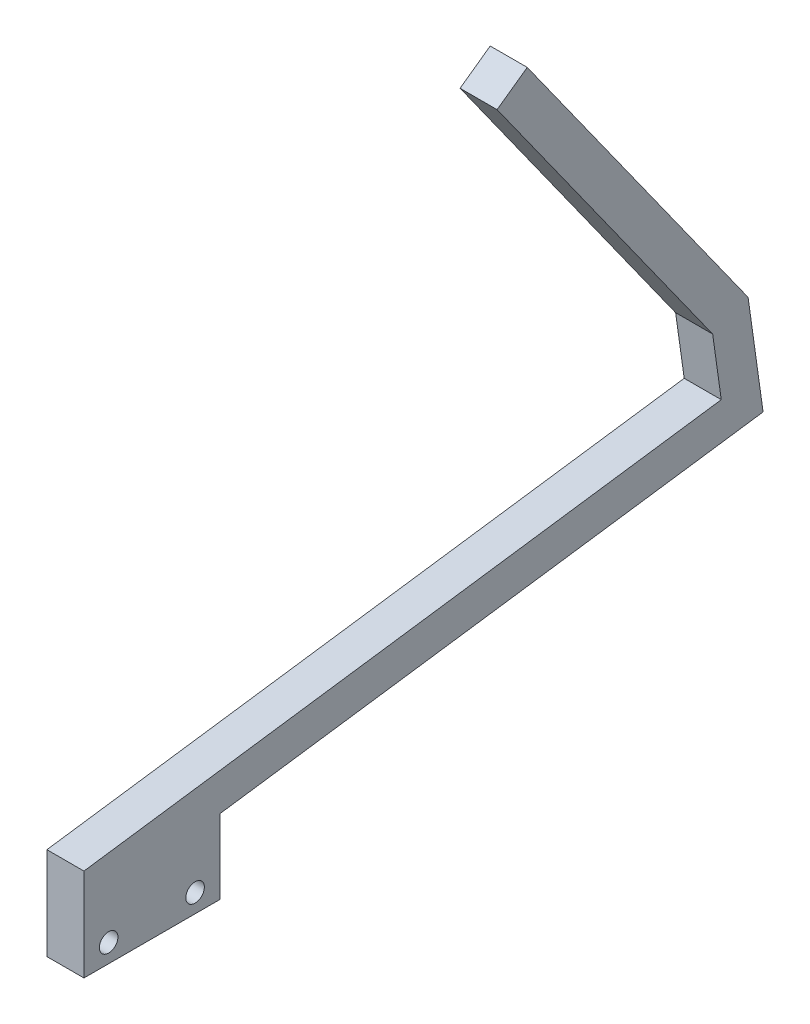
ISO-10303-21;
HEADER;
FILE_DESCRIPTION(('STEP AP214'),'2;1');
FILE_NAME('part.step','',(''),(''),'','','');
FILE_SCHEMA(('AUTOMOTIVE_DESIGN { 1 0 10303 214 1 1 1 1 }'));
ENDSEC;
DATA;
#1=APPLICATION_CONTEXT('core data for automotive mechanical design processes');
#2=APPLICATION_PROTOCOL_DEFINITION('international standard','automotive_design',2000,#1);
#3=PRODUCT_CONTEXT('',#1,'mechanical');
#4=PRODUCT('Part','Part','',(#3));
#5=PRODUCT_RELATED_PRODUCT_CATEGORY('part','',(#4));
#6=PRODUCT_DEFINITION_FORMATION('','',#4);
#7=PRODUCT_DEFINITION_CONTEXT('part definition',#1,'design');
#8=PRODUCT_DEFINITION('design','',#6,#7);
#9=PRODUCT_DEFINITION_SHAPE('','',#8);
#10=(LENGTH_UNIT() NAMED_UNIT(*) SI_UNIT(.MILLI.,.METRE.));
#11=(NAMED_UNIT(*) PLANE_ANGLE_UNIT() SI_UNIT($,.RADIAN.));
#12=(NAMED_UNIT(*) SI_UNIT($,.STERADIAN.) SOLID_ANGLE_UNIT());
#13=UNCERTAINTY_MEASURE_WITH_UNIT(LENGTH_MEASURE(1.E-05),#10,'distance_accuracy_value','');
#14=(GEOMETRIC_REPRESENTATION_CONTEXT(3) GLOBAL_UNCERTAINTY_ASSIGNED_CONTEXT((#13)) GLOBAL_UNIT_ASSIGNED_CONTEXT((#10,
#11,#12)) REPRESENTATION_CONTEXT('',''));
#15=CARTESIAN_POINT('',(0.,0.,0.));
#16=DIRECTION('',(0.,0.,1.));
#17=DIRECTION('',(1.,0.,0.));
#18=AXIS2_PLACEMENT_3D('',#15,#16,#17);
#19=CARTESIAN_POINT('',(6.,0.,0.));
#20=DIRECTION('',(-1.,0.,0.));
#21=DIRECTION('',(0.,0.,1.));
#22=AXIS2_PLACEMENT_3D('',#19,#20,#21);
#23=PLANE('',#22);
#24=CARTESIAN_POINT('',(6.,3.,-4.));
#25=DIRECTION('',(1.,0.,0.));
#26=DIRECTION('',(0.,0.,-1.));
#27=AXIS2_PLACEMENT_3D('',#24,#25,#26);
#28=CIRCLE('',#27,1.5);
#29=CARTESIAN_POINT('',(6.,3.,-5.5));
#30=VERTEX_POINT('',#29);
#31=EDGE_CURVE('E146',#30,#30,#28,.T.);
#32=ORIENTED_EDGE('',*,*,#31,.F.);
#33=EDGE_LOOP('',(#32));
#34=FACE_BOUND('',#33,.T.);
#35=DIRECTION('',(0.,0.,-1.));
#36=VECTOR('',#35,1.);
#37=CARTESIAN_POINT('',(6.,0.,-22.));
#38=LINE('',#37,#36);
#39=CARTESIAN_POINT('',(6.,0.,0.));
#40=VERTEX_POINT('',#39);
#41=CARTESIAN_POINT('',(6.,0.,-22.));
#42=VERTEX_POINT('',#41);
#43=EDGE_CURVE('E161',#40,#42,#38,.T.);
#44=ORIENTED_EDGE('',*,*,#43,.T.);
#45=DIRECTION('',(0.,1.,0.));
#46=VECTOR('',#45,1.);
#47=CARTESIAN_POINT('',(6.,12.0329329283409,-22.));
#48=LINE('',#47,#46);
#49=CARTESIAN_POINT('',(6.,12.0329329283409,-22.));
#50=VERTEX_POINT('',#49);
#51=EDGE_CURVE('E99',#42,#50,#48,.T.);
#52=ORIENTED_EDGE('',*,*,#51,.T.);
#53=DIRECTION('',(0.,0.139173100960066,-0.99026806874157));
#54=VECTOR('',#53,1.);
#55=CARTESIAN_POINT('',(6.,24.4005263821514,-110.));
#56=LINE('',#55,#54);
#57=CARTESIAN_POINT('',(6.,24.4005263821514,-110.));
#58=VERTEX_POINT('',#57);
#59=EDGE_CURVE('E182',#50,#58,#56,.T.);
#60=ORIENTED_EDGE('',*,*,#59,.T.);
#61=DIRECTION('',(0.,0.99026806874157,0.139173100960066));
#62=VECTOR('',#61,1.);
#63=CARTESIAN_POINT('',(6.,41.6991241959934,-107.568840624062));
#64=LINE('',#63,#62);
#65=CARTESIAN_POINT('',(6.,41.6991241959934,-107.568840624062));
#66=VERTEX_POINT('',#65);
#67=EDGE_CURVE('E201',#58,#66,#64,.T.);
#68=ORIENTED_EDGE('',*,*,#67,.T.);
#69=DIRECTION('',(0.,0.814040564378037,0.58080802297066));
#70=VECTOR('',#69,1.);
#71=CARTESIAN_POINT('',(6.,91.830419974695,-71.8007719745203));
#72=LINE('',#71,#70);
#73=CARTESIAN_POINT('',(6.,91.830419974695,-71.8007719745203));
#74=VERTEX_POINT('',#73);
#75=EDGE_CURVE('E198',#66,#74,#72,.T.);
#76=ORIENTED_EDGE('',*,*,#75,.T.);
#77=DIRECTION('',(0.,-0.58080802297066,0.814040564378037));
#78=VECTOR('',#77,1.);
#79=CARTESIAN_POINT('',(6.,88.345571836871,-66.916528588252));
#80=LINE('',#79,#78);
#81=CARTESIAN_POINT('',(6.,88.345571836871,-66.916528588252));
#82=VERTEX_POINT('',#81);
#83=EDGE_CURVE('E200',#74,#82,#80,.T.);
#84=ORIENTED_EDGE('',*,*,#83,.T.);
#85=DIRECTION('',(0.,-0.814040564378037,-0.58080802297066));
#86=VECTOR('',#85,1.);
#87=CARTESIAN_POINT('',(6.,39.4097768762561,-101.83162197219));
#88=LINE('',#87,#86);
#89=CARTESIAN_POINT('',(6.,39.4097768762561,-101.83162197219));
#90=VERTEX_POINT('',#89);
#91=EDGE_CURVE('E124',#82,#90,#88,.T.);
#92=ORIENTED_EDGE('',*,*,#91,.T.);
#93=DIRECTION('',(0.,-0.99026806874157,-0.139173100960066));
#94=VECTOR('',#93,1.);
#95=CARTESIAN_POINT('',(6.,29.5070961888404,-103.22335298179));
#96=LINE('',#95,#94);
#97=CARTESIAN_POINT('',(6.,29.5070961888404,-103.22335298179));
#98=VERTEX_POINT('',#97);
#99=EDGE_CURVE('E118',#90,#98,#96,.T.);
#100=ORIENTED_EDGE('',*,*,#99,.T.);
#101=DIRECTION('',(0.,-0.139173100960066,0.99026806874157));
#102=VECTOR('',#101,1.);
#103=CARTESIAN_POINT('',(6.,15.,0.));
#104=LINE('',#103,#102);
#105=CARTESIAN_POINT('',(6.,15.,0.));
#106=VERTEX_POINT('',#105);
#107=EDGE_CURVE('E122',#98,#106,#104,.T.);
#108=ORIENTED_EDGE('',*,*,#107,.T.);
#109=DIRECTION('',(0.,-1.,0.));
#110=VECTOR('',#109,1.);
#111=CARTESIAN_POINT('',(6.,0.,0.));
#112=LINE('',#111,#110);
#113=EDGE_CURVE('E50',#106,#40,#112,.T.);
#114=ORIENTED_EDGE('',*,*,#113,.T.);
#115=EDGE_LOOP('',(#44,#52,#60,#68,#76,#84,#92,#100,#108,#114));
#116=FACE_BOUND('',#115,.T.);
#117=CARTESIAN_POINT('',(6.,3.,-18.));
#118=DIRECTION('',(1.,0.,0.));
#119=DIRECTION('',(0.,0.,-1.));
#120=AXIS2_PLACEMENT_3D('',#117,#118,#119);
#121=CIRCLE('',#120,1.5);
#122=CARTESIAN_POINT('',(6.,3.,-19.5));
#123=VERTEX_POINT('',#122);
#124=EDGE_CURVE('E212',#123,#123,#121,.T.);
#125=ORIENTED_EDGE('',*,*,#124,.F.);
#126=EDGE_LOOP('',(#125));
#127=FACE_BOUND('',#126,.T.);
#128=ADVANCED_FACE('F33',(#34,#116,#127),#23,.F.);
#129=CARTESIAN_POINT('',(0.,0.,0.));
#130=DIRECTION('',(-1.,0.,0.));
#131=DIRECTION('',(0.,0.,1.));
#132=AXIS2_PLACEMENT_3D('',#129,#130,#131);
#133=PLANE('',#132);
#134=CARTESIAN_POINT('',(0.,3.,-4.));
#135=DIRECTION('',(1.,0.,0.));
#136=DIRECTION('',(0.,0.,-1.));
#137=AXIS2_PLACEMENT_3D('',#134,#135,#136);
#138=CIRCLE('',#137,1.5);
#139=CARTESIAN_POINT('',(0.,3.,-5.5));
#140=VERTEX_POINT('',#139);
#141=EDGE_CURVE('E209',#140,#140,#138,.T.);
#142=ORIENTED_EDGE('',*,*,#141,.T.);
#143=EDGE_LOOP('',(#142));
#144=FACE_BOUND('',#143,.T.);
#145=DIRECTION('',(0.,0.,-1.));
#146=VECTOR('',#145,1.);
#147=CARTESIAN_POINT('',(0.,0.,-22.));
#148=LINE('',#147,#146);
#149=CARTESIAN_POINT('',(0.,0.,0.));
#150=VERTEX_POINT('',#149);
#151=CARTESIAN_POINT('',(0.,0.,-22.));
#152=VERTEX_POINT('',#151);
#153=EDGE_CURVE('E142',#150,#152,#148,.T.);
#154=ORIENTED_EDGE('',*,*,#153,.F.);
#155=DIRECTION('',(0.,-1.,0.));
#156=VECTOR('',#155,1.);
#157=CARTESIAN_POINT('',(0.,0.,0.));
#158=LINE('',#157,#156);
#159=CARTESIAN_POINT('',(0.,15.,0.));
#160=VERTEX_POINT('',#159);
#161=EDGE_CURVE('E91',#160,#150,#158,.T.);
#162=ORIENTED_EDGE('',*,*,#161,.F.);
#163=DIRECTION('',(0.,-0.139173100960066,0.99026806874157));
#164=VECTOR('',#163,1.);
#165=CARTESIAN_POINT('',(0.,15.,0.));
#166=LINE('',#165,#164);
#167=CARTESIAN_POINT('',(0.,29.5070961888404,-103.22335298179));
#168=VERTEX_POINT('',#167);
#169=EDGE_CURVE('E85',#168,#160,#166,.T.);
#170=ORIENTED_EDGE('',*,*,#169,.F.);
#171=DIRECTION('',(0.,-0.99026806874157,-0.139173100960066));
#172=VECTOR('',#171,1.);
#173=CARTESIAN_POINT('',(0.,29.5070961888404,-103.22335298179));
#174=LINE('',#173,#172);
#175=CARTESIAN_POINT('',(0.,39.4097768762561,-101.83162197219));
#176=VERTEX_POINT('',#175);
#177=EDGE_CURVE('E132',#176,#168,#174,.T.);
#178=ORIENTED_EDGE('',*,*,#177,.F.);
#179=DIRECTION('',(0.,-0.814040564378037,-0.58080802297066));
#180=VECTOR('',#179,1.);
#181=CARTESIAN_POINT('',(0.,39.4097768762561,-101.83162197219));
#182=LINE('',#181,#180);
#183=CARTESIAN_POINT('',(0.,88.345571836871,-66.916528588252));
#184=VERTEX_POINT('',#183);
#185=EDGE_CURVE('E156',#184,#176,#182,.T.);
#186=ORIENTED_EDGE('',*,*,#185,.F.);
#187=DIRECTION('',(0.,-0.58080802297066,0.814040564378037));
#188=VECTOR('',#187,1.);
#189=CARTESIAN_POINT('',(0.,88.345571836871,-66.916528588252));
#190=LINE('',#189,#188);
#191=CARTESIAN_POINT('',(0.,91.830419974695,-71.8007719745203));
#192=VERTEX_POINT('',#191);
#193=EDGE_CURVE('E154',#192,#184,#190,.T.);
#194=ORIENTED_EDGE('',*,*,#193,.F.);
#195=DIRECTION('',(0.,0.814040564378037,0.58080802297066));
#196=VECTOR('',#195,1.);
#197=CARTESIAN_POINT('',(0.,91.830419974695,-71.8007719745203));
#198=LINE('',#197,#196);
#199=CARTESIAN_POINT('',(0.,41.6991241959934,-107.568840624062));
#200=VERTEX_POINT('',#199);
#201=EDGE_CURVE('E152',#200,#192,#198,.T.);
#202=ORIENTED_EDGE('',*,*,#201,.F.);
#203=DIRECTION('',(0.,0.99026806874157,0.139173100960066));
#204=VECTOR('',#203,1.);
#205=CARTESIAN_POINT('',(0.,41.6991241959934,-107.568840624062));
#206=LINE('',#205,#204);
#207=CARTESIAN_POINT('',(0.,24.4005263821514,-110.));
#208=VERTEX_POINT('',#207);
#209=EDGE_CURVE('E150',#208,#200,#206,.T.);
#210=ORIENTED_EDGE('',*,*,#209,.F.);
#211=DIRECTION('',(0.,0.139173100960066,-0.99026806874157));
#212=VECTOR('',#211,1.);
#213=CARTESIAN_POINT('',(0.,24.4005263821514,-110.));
#214=LINE('',#213,#212);
#215=CARTESIAN_POINT('',(0.,12.0329329283409,-22.));
#216=VERTEX_POINT('',#215);
#217=EDGE_CURVE('E148',#216,#208,#214,.T.);
#218=ORIENTED_EDGE('',*,*,#217,.F.);
#219=DIRECTION('',(0.,1.,0.));
#220=VECTOR('',#219,1.);
#221=CARTESIAN_POINT('',(0.,12.0329329283409,-22.));
#222=LINE('',#221,#220);
#223=EDGE_CURVE('E145',#152,#216,#222,.T.);
#224=ORIENTED_EDGE('',*,*,#223,.F.);
#225=EDGE_LOOP('',(#154,#162,#170,#178,#186,#194,#202,#210,#218,#224));
#226=FACE_BOUND('',#225,.T.);
#227=CARTESIAN_POINT('',(0.,3.,-18.));
#228=DIRECTION('',(1.,0.,0.));
#229=DIRECTION('',(0.,0.,-1.));
#230=AXIS2_PLACEMENT_3D('',#227,#228,#229);
#231=CIRCLE('',#230,1.5);
#232=CARTESIAN_POINT('',(0.,3.,-19.5));
#233=VERTEX_POINT('',#232);
#234=EDGE_CURVE('E215',#233,#233,#231,.T.);
#235=ORIENTED_EDGE('',*,*,#234,.T.);
#236=EDGE_LOOP('',(#235));
#237=FACE_BOUND('',#236,.T.);
#238=ADVANCED_FACE('F186',(#144,#226,#237),#133,.T.);
#239=CARTESIAN_POINT('',(6.,0.,-22.));
#240=DIRECTION('',(0.,1.,0.));
#241=DIRECTION('',(0.,0.,1.));
#242=AXIS2_PLACEMENT_3D('',#239,#240,#241);
#243=PLANE('',#242);
#244=ORIENTED_EDGE('',*,*,#153,.T.);
#245=DIRECTION('',(-1.,0.,0.));
#246=VECTOR('',#245,1.);
#247=CARTESIAN_POINT('',(6.,0.,-22.));
#248=LINE('',#247,#246);
#249=EDGE_CURVE('E11',#42,#152,#248,.T.);
#250=ORIENTED_EDGE('',*,*,#249,.F.);
#251=ORIENTED_EDGE('',*,*,#43,.F.);
#252=DIRECTION('',(-1.,0.,0.));
#253=VECTOR('',#252,1.);
#254=CARTESIAN_POINT('',(6.,0.,0.));
#255=LINE('',#254,#253);
#256=EDGE_CURVE('E138',#40,#150,#255,.T.);
#257=ORIENTED_EDGE('',*,*,#256,.T.);
#258=EDGE_LOOP('',(#244,#250,#251,#257));
#259=FACE_BOUND('',#258,.T.);
#260=ADVANCED_FACE('F35',(#259),#243,.F.);
#261=CARTESIAN_POINT('',(6.,12.0329329283409,-22.));
#262=DIRECTION('',(0.,0.,1.));
#263=DIRECTION('',(1.,0.,0.));
#264=AXIS2_PLACEMENT_3D('',#261,#262,#263);
#265=PLANE('',#264);
#266=ORIENTED_EDGE('',*,*,#223,.T.);
#267=DIRECTION('',(-1.,0.,0.));
#268=VECTOR('',#267,1.);
#269=CARTESIAN_POINT('',(6.,12.0329329283409,-22.));
#270=LINE('',#269,#268);
#271=EDGE_CURVE('E42',#50,#216,#270,.T.);
#272=ORIENTED_EDGE('',*,*,#271,.F.);
#273=ORIENTED_EDGE('',*,*,#51,.F.);
#274=ORIENTED_EDGE('',*,*,#249,.T.);
#275=EDGE_LOOP('',(#266,#272,#273,#274));
#276=FACE_BOUND('',#275,.T.);
#277=ADVANCED_FACE('F256',(#276),#265,.F.);
#278=CARTESIAN_POINT('',(6.,24.4005263821514,-110.));
#279=DIRECTION('',(0.,0.99026806874157,0.139173100960066));
#280=DIRECTION('',(0.,-0.139173100960066,0.99026806874157));
#281=AXIS2_PLACEMENT_3D('',#278,#279,#280);
#282=PLANE('',#281);
#283=ORIENTED_EDGE('',*,*,#217,.T.);
#284=DIRECTION('',(-1.,0.,0.));
#285=VECTOR('',#284,1.);
#286=CARTESIAN_POINT('',(6.,24.4005263821514,-110.));
#287=LINE('',#286,#285);
#288=EDGE_CURVE('E174',#58,#208,#287,.T.);
#289=ORIENTED_EDGE('',*,*,#288,.F.);
#290=ORIENTED_EDGE('',*,*,#59,.F.);
#291=ORIENTED_EDGE('',*,*,#271,.T.);
#292=EDGE_LOOP('',(#283,#289,#290,#291));
#293=FACE_BOUND('',#292,.T.);
#294=ADVANCED_FACE('F180',(#293),#282,.F.);
#295=CARTESIAN_POINT('',(6.,41.6991241959934,-107.568840624062));
#296=DIRECTION('',(0.,-0.139173100960066,0.99026806874157));
#297=DIRECTION('',(0.,-0.99026806874157,-0.139173100960066));
#298=AXIS2_PLACEMENT_3D('',#295,#296,#297);
#299=PLANE('',#298);
#300=ORIENTED_EDGE('',*,*,#209,.T.);
#301=DIRECTION('',(-1.,0.,0.));
#302=VECTOR('',#301,1.);
#303=CARTESIAN_POINT('',(6.,41.6991241959934,-107.568840624062));
#304=LINE('',#303,#302);
#305=EDGE_CURVE('E171',#66,#200,#304,.T.);
#306=ORIENTED_EDGE('',*,*,#305,.F.);
#307=ORIENTED_EDGE('',*,*,#67,.F.);
#308=ORIENTED_EDGE('',*,*,#288,.T.);
#309=EDGE_LOOP('',(#300,#306,#307,#308));
#310=FACE_BOUND('',#309,.T.);
#311=ADVANCED_FACE('F192',(#310),#299,.F.);
#312=CARTESIAN_POINT('',(6.,91.830419974695,-71.8007719745203));
#313=DIRECTION('',(0.,-0.58080802297066,0.814040564378037));
#314=DIRECTION('',(0.,-0.814040564378037,-0.58080802297066));
#315=AXIS2_PLACEMENT_3D('',#312,#313,#314);
#316=PLANE('',#315);
#317=ORIENTED_EDGE('',*,*,#201,.T.);
#318=DIRECTION('',(-1.,0.,0.));
#319=VECTOR('',#318,1.);
#320=CARTESIAN_POINT('',(6.,91.830419974695,-71.8007719745203));
#321=LINE('',#320,#319);
#322=EDGE_CURVE('E168',#74,#192,#321,.T.);
#323=ORIENTED_EDGE('',*,*,#322,.F.);
#324=ORIENTED_EDGE('',*,*,#75,.F.);
#325=ORIENTED_EDGE('',*,*,#305,.T.);
#326=EDGE_LOOP('',(#317,#323,#324,#325));
#327=FACE_BOUND('',#326,.T.);
#328=ADVANCED_FACE('F196',(#327),#316,.F.);
#329=CARTESIAN_POINT('',(6.,88.345571836871,-66.916528588252));
#330=DIRECTION('',(0.,-0.814040564378037,-0.58080802297066));
#331=DIRECTION('',(0.,0.58080802297066,-0.814040564378037));
#332=AXIS2_PLACEMENT_3D('',#329,#330,#331);
#333=PLANE('',#332);
#334=ORIENTED_EDGE('',*,*,#193,.T.);
#335=DIRECTION('',(-1.,0.,0.));
#336=VECTOR('',#335,1.);
#337=CARTESIAN_POINT('',(6.,88.345571836871,-66.916528588252));
#338=LINE('',#337,#336);
#339=EDGE_CURVE('E165',#82,#184,#338,.T.);
#340=ORIENTED_EDGE('',*,*,#339,.F.);
#341=ORIENTED_EDGE('',*,*,#83,.F.);
#342=ORIENTED_EDGE('',*,*,#322,.T.);
#343=EDGE_LOOP('',(#334,#340,#341,#342));
#344=FACE_BOUND('',#343,.T.);
#345=ADVANCED_FACE('F246',(#344),#333,.F.);
#346=CARTESIAN_POINT('',(6.,39.4097768762561,-101.83162197219));
#347=DIRECTION('',(0.,0.58080802297066,-0.814040564378037));
#348=DIRECTION('',(0.,0.814040564378037,0.58080802297066));
#349=AXIS2_PLACEMENT_3D('',#346,#347,#348);
#350=PLANE('',#349);
#351=ORIENTED_EDGE('',*,*,#185,.T.);
#352=DIRECTION('',(-1.,0.,0.));
#353=VECTOR('',#352,1.);
#354=CARTESIAN_POINT('',(6.,39.4097768762561,-101.83162197219));
#355=LINE('',#354,#353);
#356=EDGE_CURVE('E133',#90,#176,#355,.T.);
#357=ORIENTED_EDGE('',*,*,#356,.F.);
#358=ORIENTED_EDGE('',*,*,#91,.F.);
#359=ORIENTED_EDGE('',*,*,#339,.T.);
#360=EDGE_LOOP('',(#351,#357,#358,#359));
#361=FACE_BOUND('',#360,.T.);
#362=ADVANCED_FACE('F243',(#361),#350,.F.);
#363=CARTESIAN_POINT('',(6.,29.5070961888404,-103.22335298179));
#364=DIRECTION('',(0.,0.139173100960066,-0.99026806874157));
#365=DIRECTION('',(0.,0.99026806874157,0.139173100960066));
#366=AXIS2_PLACEMENT_3D('',#363,#364,#365);
#367=PLANE('',#366);
#368=ORIENTED_EDGE('',*,*,#177,.T.);
#369=DIRECTION('',(-1.,0.,0.));
#370=VECTOR('',#369,1.);
#371=CARTESIAN_POINT('',(6.,29.5070961888404,-103.22335298179));
#372=LINE('',#371,#370);
#373=EDGE_CURVE('E129',#98,#168,#372,.T.);
#374=ORIENTED_EDGE('',*,*,#373,.F.);
#375=ORIENTED_EDGE('',*,*,#99,.F.);
#376=ORIENTED_EDGE('',*,*,#356,.T.);
#377=EDGE_LOOP('',(#368,#374,#375,#376));
#378=FACE_BOUND('',#377,.T.);
#379=ADVANCED_FACE('F130',(#378),#367,.F.);
#380=CARTESIAN_POINT('',(6.,15.,0.));
#381=DIRECTION('',(0.,-0.99026806874157,-0.139173100960066));
#382=DIRECTION('',(0.,0.139173100960066,-0.99026806874157));
#383=AXIS2_PLACEMENT_3D('',#380,#381,#382);
#384=PLANE('',#383);
#385=ORIENTED_EDGE('',*,*,#169,.T.);
#386=DIRECTION('',(-1.,0.,0.));
#387=VECTOR('',#386,1.);
#388=CARTESIAN_POINT('',(6.,15.,0.));
#389=LINE('',#388,#387);
#390=EDGE_CURVE('E134',#106,#160,#389,.T.);
#391=ORIENTED_EDGE('',*,*,#390,.F.);
#392=ORIENTED_EDGE('',*,*,#107,.F.);
#393=ORIENTED_EDGE('',*,*,#373,.T.);
#394=EDGE_LOOP('',(#385,#391,#392,#393));
#395=FACE_BOUND('',#394,.T.);
#396=ADVANCED_FACE('F136',(#395),#384,.F.);
#397=CARTESIAN_POINT('',(6.,0.,0.));
#398=DIRECTION('',(0.,0.,-1.));
#399=DIRECTION('',(-1.,0.,0.));
#400=AXIS2_PLACEMENT_3D('',#397,#398,#399);
#401=PLANE('',#400);
#402=ORIENTED_EDGE('',*,*,#161,.T.);
#403=ORIENTED_EDGE('',*,*,#256,.F.);
#404=ORIENTED_EDGE('',*,*,#113,.F.);
#405=ORIENTED_EDGE('',*,*,#390,.T.);
#406=EDGE_LOOP('',(#402,#403,#404,#405));
#407=FACE_BOUND('',#406,.T.);
#408=ADVANCED_FACE('F236',(#407),#401,.F.);
#409=CARTESIAN_POINT('',(6.,3.,-4.));
#410=DIRECTION('',(-1.,0.,0.));
#411=DIRECTION('',(0.,0.,1.));
#412=AXIS2_PLACEMENT_3D('',#409,#410,#411);
#413=CYLINDRICAL_SURFACE('',#412,1.5);
#414=ORIENTED_EDGE('',*,*,#31,.T.);
#415=EDGE_LOOP('',(#414));
#416=FACE_BOUND('',#415,.T.);
#417=ORIENTED_EDGE('',*,*,#141,.F.);
#418=EDGE_LOOP('',(#417));
#419=FACE_BOUND('',#418,.T.);
#420=ADVANCED_FACE('F233',(#416,#419),#413,.F.);
#421=CARTESIAN_POINT('',(6.,3.,-18.));
#422=DIRECTION('',(-1.,0.,0.));
#423=DIRECTION('',(0.,0.,1.));
#424=AXIS2_PLACEMENT_3D('',#421,#422,#423);
#425=CYLINDRICAL_SURFACE('',#424,1.5);
#426=ORIENTED_EDGE('',*,*,#124,.T.);
#427=EDGE_LOOP('',(#426));
#428=FACE_BOUND('',#427,.T.);
#429=ORIENTED_EDGE('',*,*,#234,.F.);
#430=EDGE_LOOP('',(#429));
#431=FACE_BOUND('',#430,.T.);
#432=ADVANCED_FACE('F221',(#428,#431),#425,.F.);
#433=CLOSED_SHELL('',(#128,#238,#260,#277,#294,#311,#328,#345,#362,#379,#396,#408,#420,#432));
#434=MANIFOLD_SOLID_BREP('B2',#433);
#435=ADVANCED_BREP_SHAPE_REPRESENTATION('',(#18,#434),#14);
#436=SHAPE_DEFINITION_REPRESENTATION(#9,#435);
ENDSEC;
END-ISO-10303-21;
